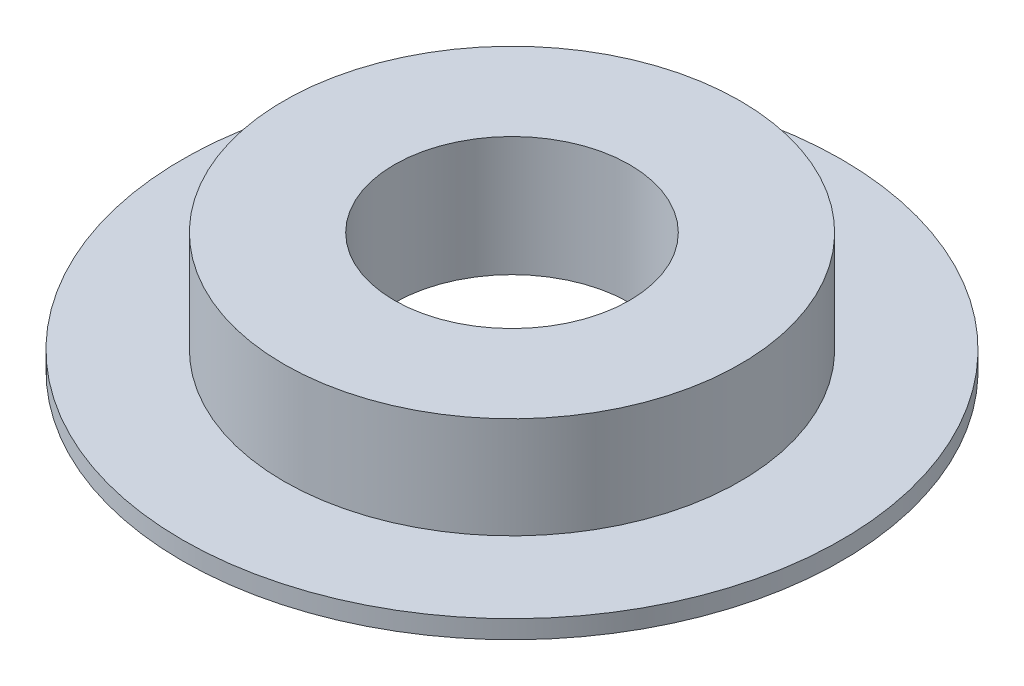
ISO-10303-21;
HEADER;
FILE_DESCRIPTION(('STEP AP214'),'2;1');
FILE_NAME('part.step','',(''),(''),'','','');
FILE_SCHEMA(('AUTOMOTIVE_DESIGN { 1 0 10303 214 1 1 1 1 }'));
ENDSEC;
DATA;
#1=APPLICATION_CONTEXT('core data for automotive mechanical design processes');
#2=APPLICATION_PROTOCOL_DEFINITION('international standard','automotive_design',2000,#1);
#3=PRODUCT_CONTEXT('',#1,'mechanical');
#4=PRODUCT('Part','Part','',(#3));
#5=PRODUCT_RELATED_PRODUCT_CATEGORY('part','',(#4));
#6=PRODUCT_DEFINITION_FORMATION('','',#4);
#7=PRODUCT_DEFINITION_CONTEXT('part definition',#1,'design');
#8=PRODUCT_DEFINITION('design','',#6,#7);
#9=PRODUCT_DEFINITION_SHAPE('','',#8);
#10=(LENGTH_UNIT() NAMED_UNIT(*) SI_UNIT(.MILLI.,.METRE.));
#11=(NAMED_UNIT(*) PLANE_ANGLE_UNIT() SI_UNIT($,.RADIAN.));
#12=(NAMED_UNIT(*) SI_UNIT($,.STERADIAN.) SOLID_ANGLE_UNIT());
#13=UNCERTAINTY_MEASURE_WITH_UNIT(LENGTH_MEASURE(1.E-05),#10,'distance_accuracy_value','');
#14=(GEOMETRIC_REPRESENTATION_CONTEXT(3) GLOBAL_UNCERTAINTY_ASSIGNED_CONTEXT((#13)) GLOBAL_UNIT_ASSIGNED_CONTEXT((#10,
#11,#12)) REPRESENTATION_CONTEXT('',''));
#15=CARTESIAN_POINT('',(0.,0.,0.));
#16=DIRECTION('',(0.,0.,1.));
#17=DIRECTION('',(1.,0.,0.));
#18=AXIS2_PLACEMENT_3D('',#15,#16,#17);
#19=CARTESIAN_POINT('',(-45.1215872800419,8.97288931788123,0.));
#20=DIRECTION('',(0.,1.,0.));
#21=DIRECTION('',(0.,0.,1.));
#22=AXIS2_PLACEMENT_3D('',#19,#20,#21);
#23=PLANE('',#22);
#24=CARTESIAN_POINT('',(-33.5215872800419,8.97288931788123,0.));
#25=DIRECTION('',(0.,1.,0.));
#26=DIRECTION('',(0.,0.,1.));
#27=AXIS2_PLACEMENT_3D('',#24,#25,#26);
#28=CIRCLE('',#27,22.5);
#29=CARTESIAN_POINT('',(-33.5215872800419,8.97288931788123,22.5));
#30=VERTEX_POINT('',#29);
#31=EDGE_CURVE('E10',#30,#30,#28,.T.);
#32=ORIENTED_EDGE('',*,*,#31,.T.);
#33=EDGE_LOOP('',(#32));
#34=FACE_BOUND('',#33,.T.);
#35=CARTESIAN_POINT('',(-33.5215872800419,8.97288931788123,0.));
#36=DIRECTION('',(0.,1.,0.));
#37=DIRECTION('',(0.,0.,1.));
#38=AXIS2_PLACEMENT_3D('',#35,#36,#37);
#39=CIRCLE('',#38,11.6);
#40=CARTESIAN_POINT('',(-33.5215872800419,8.97288931788123,11.6));
#41=VERTEX_POINT('',#40);
#42=EDGE_CURVE('E53',#41,#41,#39,.T.);
#43=ORIENTED_EDGE('',*,*,#42,.F.);
#44=EDGE_LOOP('',(#43));
#45=FACE_BOUND('',#44,.T.);
#46=ADVANCED_FACE('F31',(#34,#45),#23,.T.);
#47=CARTESIAN_POINT('',(-33.5215872800419,13.9728893178812,0.));
#48=DIRECTION('',(0.,1.,0.));
#49=DIRECTION('',(0.,0.,1.));
#50=AXIS2_PLACEMENT_3D('',#47,#48,#49);
#51=CYLINDRICAL_SURFACE('',#50,22.5);
#52=CARTESIAN_POINT('',(-33.5215872800419,-1.02711068211877,0.));
#53=DIRECTION('',(0.,1.,0.));
#54=DIRECTION('',(0.,0.,1.));
#55=AXIS2_PLACEMENT_3D('',#52,#53,#54);
#56=CIRCLE('',#55,22.5);
#57=CARTESIAN_POINT('',(-33.5215872800419,-1.02711068211877,22.5));
#58=VERTEX_POINT('',#57);
#59=EDGE_CURVE('E37',#58,#58,#56,.T.);
#60=ORIENTED_EDGE('',*,*,#59,.T.);
#61=EDGE_LOOP('',(#60));
#62=FACE_BOUND('',#61,.T.);
#63=ORIENTED_EDGE('',*,*,#31,.F.);
#64=EDGE_LOOP('',(#63));
#65=FACE_BOUND('',#64,.T.);
#66=ADVANCED_FACE('F61',(#62,#65),#51,.T.);
#67=CARTESIAN_POINT('',(-56.0215872800419,-1.02711068211877,0.));
#68=DIRECTION('',(0.,1.,0.));
#69=DIRECTION('',(0.,0.,1.));
#70=AXIS2_PLACEMENT_3D('',#67,#68,#69);
#71=PLANE('',#70);
#72=CARTESIAN_POINT('',(-33.5215872800419,-1.02711068211877,0.));
#73=DIRECTION('',(0.,1.,0.));
#74=DIRECTION('',(0.,0.,1.));
#75=AXIS2_PLACEMENT_3D('',#72,#73,#74);
#76=CIRCLE('',#75,32.5);
#77=CARTESIAN_POINT('',(-33.5215872800419,-1.02711068211877,32.5));
#78=VERTEX_POINT('',#77);
#79=EDGE_CURVE('E41',#78,#78,#76,.T.);
#80=ORIENTED_EDGE('',*,*,#79,.T.);
#81=EDGE_LOOP('',(#80));
#82=FACE_BOUND('',#81,.T.);
#83=ORIENTED_EDGE('',*,*,#59,.F.);
#84=EDGE_LOOP('',(#83));
#85=FACE_BOUND('',#84,.T.);
#86=ADVANCED_FACE('F65',(#82,#85),#71,.T.);
#87=CARTESIAN_POINT('',(-33.5215872800419,13.9728893178812,0.));
#88=DIRECTION('',(0.,1.,0.));
#89=DIRECTION('',(0.,0.,1.));
#90=AXIS2_PLACEMENT_3D('',#87,#88,#89);
#91=CYLINDRICAL_SURFACE('',#90,32.5);
#92=CARTESIAN_POINT('',(-33.5215872800419,-2.82711068211877,0.));
#93=DIRECTION('',(0.,1.,0.));
#94=DIRECTION('',(0.,0.,1.));
#95=AXIS2_PLACEMENT_3D('',#92,#93,#94);
#96=CIRCLE('',#95,32.5);
#97=CARTESIAN_POINT('',(-33.5215872800419,-2.82711068211877,32.5));
#98=VERTEX_POINT('',#97);
#99=EDGE_CURVE('E45',#98,#98,#96,.T.);
#100=ORIENTED_EDGE('',*,*,#99,.T.);
#101=EDGE_LOOP('',(#100));
#102=FACE_BOUND('',#101,.T.);
#103=ORIENTED_EDGE('',*,*,#79,.F.);
#104=EDGE_LOOP('',(#103));
#105=FACE_BOUND('',#104,.T.);
#106=ADVANCED_FACE('F69',(#102,#105),#91,.T.);
#107=CARTESIAN_POINT('',(-66.0215872800419,-2.82711068211877,0.));
#108=DIRECTION('',(0.,-1.,0.));
#109=DIRECTION('',(0.,0.,-1.));
#110=AXIS2_PLACEMENT_3D('',#107,#108,#109);
#111=PLANE('',#110);
#112=CARTESIAN_POINT('',(-33.5215872800419,-2.82711068211877,0.));
#113=DIRECTION('',(0.,1.,0.));
#114=DIRECTION('',(0.,0.,1.));
#115=AXIS2_PLACEMENT_3D('',#112,#113,#114);
#116=CIRCLE('',#115,11.6);
#117=CARTESIAN_POINT('',(-33.5215872800419,-2.82711068211877,11.6));
#118=VERTEX_POINT('',#117);
#119=EDGE_CURVE('E50',#118,#118,#116,.T.);
#120=ORIENTED_EDGE('',*,*,#119,.T.);
#121=EDGE_LOOP('',(#120));
#122=FACE_BOUND('',#121,.T.);
#123=ORIENTED_EDGE('',*,*,#99,.F.);
#124=EDGE_LOOP('',(#123));
#125=FACE_BOUND('',#124,.T.);
#126=ADVANCED_FACE('F76',(#122,#125),#111,.T.);
#127=CARTESIAN_POINT('',(-33.5215872800419,13.9728893178812,0.));
#128=DIRECTION('',(0.,1.,0.));
#129=DIRECTION('',(0.,0.,1.));
#130=AXIS2_PLACEMENT_3D('',#127,#128,#129);
#131=CYLINDRICAL_SURFACE('',#130,11.6);
#132=ORIENTED_EDGE('',*,*,#42,.T.);
#133=EDGE_LOOP('',(#132));
#134=FACE_BOUND('',#133,.T.);
#135=ORIENTED_EDGE('',*,*,#119,.F.);
#136=EDGE_LOOP('',(#135));
#137=FACE_BOUND('',#136,.T.);
#138=ADVANCED_FACE('F57',(#134,#137),#131,.F.);
#139=CLOSED_SHELL('',(#46,#66,#86,#106,#126,#138));
#140=MANIFOLD_SOLID_BREP('B2',#139);
#141=ADVANCED_BREP_SHAPE_REPRESENTATION('',(#18,#140),#14);
#142=SHAPE_DEFINITION_REPRESENTATION(#9,#141);
ENDSEC;
END-ISO-10303-21;
